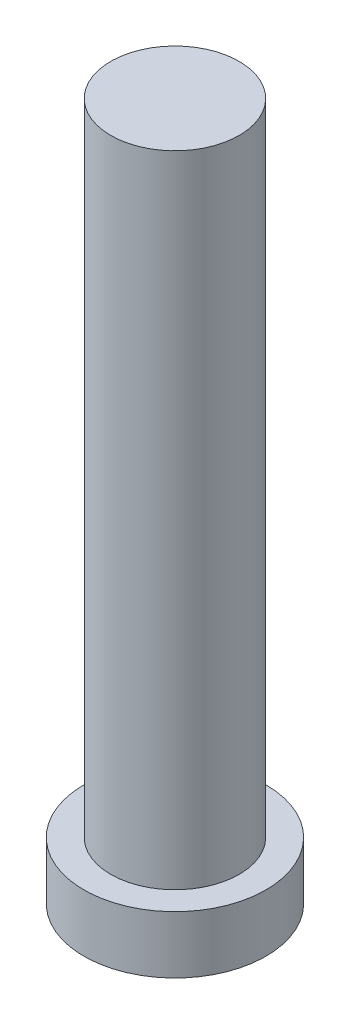
ISO-10303-21;
HEADER;
FILE_DESCRIPTION(('STEP AP214'),'2;1');
FILE_NAME('part.step','',(''),(''),'','','');
FILE_SCHEMA(('AUTOMOTIVE_DESIGN { 1 0 10303 214 1 1 1 1 }'));
ENDSEC;
DATA;
#1=APPLICATION_CONTEXT('core data for automotive mechanical design processes');
#2=APPLICATION_PROTOCOL_DEFINITION('international standard','automotive_design',2000,#1);
#3=PRODUCT_CONTEXT('',#1,'mechanical');
#4=PRODUCT('Part','Part','',(#3));
#5=PRODUCT_RELATED_PRODUCT_CATEGORY('part','',(#4));
#6=PRODUCT_DEFINITION_FORMATION('','',#4);
#7=PRODUCT_DEFINITION_CONTEXT('part definition',#1,'design');
#8=PRODUCT_DEFINITION('design','',#6,#7);
#9=PRODUCT_DEFINITION_SHAPE('','',#8);
#10=(LENGTH_UNIT() NAMED_UNIT(*) SI_UNIT(.MILLI.,.METRE.));
#11=(NAMED_UNIT(*) PLANE_ANGLE_UNIT() SI_UNIT($,.RADIAN.));
#12=(NAMED_UNIT(*) SI_UNIT($,.STERADIAN.) SOLID_ANGLE_UNIT());
#13=UNCERTAINTY_MEASURE_WITH_UNIT(LENGTH_MEASURE(1.E-05),#10,'distance_accuracy_value','');
#14=(GEOMETRIC_REPRESENTATION_CONTEXT(3) GLOBAL_UNCERTAINTY_ASSIGNED_CONTEXT((#13)) GLOBAL_UNIT_ASSIGNED_CONTEXT((#10,
#11,#12)) REPRESENTATION_CONTEXT('',''));
#15=CARTESIAN_POINT('',(0.,0.,0.));
#16=DIRECTION('',(0.,0.,1.));
#17=DIRECTION('',(1.,0.,0.));
#18=AXIS2_PLACEMENT_3D('',#15,#16,#17);
#19=CARTESIAN_POINT('',(0.,33.4,0.));
#20=DIRECTION('',(0.,-1.,0.));
#21=DIRECTION('',(0.,0.,-1.));
#22=AXIS2_PLACEMENT_3D('',#19,#20,#21);
#23=CYLINDRICAL_SURFACE('',#22,3.35000000000001);
#24=CARTESIAN_POINT('',(0.,33.4,0.));
#25=DIRECTION('',(0.,1.,0.));
#26=DIRECTION('',(0.,0.,1.));
#27=AXIS2_PLACEMENT_3D('',#24,#25,#26);
#28=CIRCLE('',#27,3.35000000000001);
#29=CARTESIAN_POINT('',(0.,33.4,3.35000000000001));
#30=VERTEX_POINT('',#29);
#31=EDGE_CURVE('E10',#30,#30,#28,.T.);
#32=ORIENTED_EDGE('',*,*,#31,.F.);
#33=EDGE_LOOP('',(#32));
#34=FACE_BOUND('',#33,.T.);
#35=CARTESIAN_POINT('',(0.,0.,0.));
#36=DIRECTION('',(0.,1.,0.));
#37=DIRECTION('',(0.,0.,1.));
#38=AXIS2_PLACEMENT_3D('',#35,#36,#37);
#39=CIRCLE('',#38,3.35000000000001);
#40=CARTESIAN_POINT('',(0.,0.,3.35000000000001));
#41=VERTEX_POINT('',#40);
#42=EDGE_CURVE('E38',#41,#41,#39,.T.);
#43=ORIENTED_EDGE('',*,*,#42,.T.);
#44=EDGE_LOOP('',(#43));
#45=FACE_BOUND('',#44,.T.);
#46=ADVANCED_FACE('F35',(#34,#45),#23,.T.);
#47=CARTESIAN_POINT('',(0.,33.4,0.));
#48=DIRECTION('',(0.,1.,0.));
#49=DIRECTION('',(0.,0.,1.));
#50=AXIS2_PLACEMENT_3D('',#47,#48,#49);
#51=PLANE('',#50);
#52=ORIENTED_EDGE('',*,*,#31,.T.);
#53=EDGE_LOOP('',(#52));
#54=FACE_BOUND('',#53,.T.);
#55=ADVANCED_FACE('F58',(#54),#51,.T.);
#56=CARTESIAN_POINT('',(0.,-3.,0.));
#57=DIRECTION('',(0.,1.,0.));
#58=DIRECTION('',(0.,0.,1.));
#59=AXIS2_PLACEMENT_3D('',#56,#57,#58);
#60=CYLINDRICAL_SURFACE('',#59,4.75);
#61=CARTESIAN_POINT('',(0.,-3.,0.));
#62=DIRECTION('',(0.,-1.,0.));
#63=DIRECTION('',(0.,0.,-1.));
#64=AXIS2_PLACEMENT_3D('',#61,#62,#63);
#65=CIRCLE('',#64,4.75);
#66=CARTESIAN_POINT('',(0.,-3.,-4.75));
#67=VERTEX_POINT('',#66);
#68=EDGE_CURVE('E45',#67,#67,#65,.T.);
#69=ORIENTED_EDGE('',*,*,#68,.F.);
#70=EDGE_LOOP('',(#69));
#71=FACE_BOUND('',#70,.T.);
#72=CARTESIAN_POINT('',(0.,0.,0.));
#73=DIRECTION('',(0.,-1.,0.));
#74=DIRECTION('',(0.,0.,-1.));
#75=AXIS2_PLACEMENT_3D('',#72,#73,#74);
#76=CIRCLE('',#75,4.75);
#77=CARTESIAN_POINT('',(0.,0.,-4.75));
#78=VERTEX_POINT('',#77);
#79=EDGE_CURVE('E47',#78,#78,#76,.T.);
#80=ORIENTED_EDGE('',*,*,#79,.T.);
#81=EDGE_LOOP('',(#80));
#82=FACE_BOUND('',#81,.T.);
#83=ADVANCED_FACE('F55',(#71,#82),#60,.T.);
#84=CARTESIAN_POINT('',(0.,-3.,0.));
#85=DIRECTION('',(0.,-1.,0.));
#86=DIRECTION('',(0.,0.,-1.));
#87=AXIS2_PLACEMENT_3D('',#84,#85,#86);
#88=PLANE('',#87);
#89=ORIENTED_EDGE('',*,*,#68,.T.);
#90=EDGE_LOOP('',(#89));
#91=FACE_BOUND('',#90,.T.);
#92=ADVANCED_FACE('F53',(#91),#88,.T.);
#93=CARTESIAN_POINT('',(0.,0.,0.));
#94=DIRECTION('',(0.,-1.,0.));
#95=DIRECTION('',(0.,0.,-1.));
#96=AXIS2_PLACEMENT_3D('',#93,#94,#95);
#97=PLANE('',#96);
#98=ORIENTED_EDGE('',*,*,#42,.F.);
#99=EDGE_LOOP('',(#98));
#100=FACE_BOUND('',#99,.T.);
#101=ORIENTED_EDGE('',*,*,#79,.F.);
#102=EDGE_LOOP('',(#101));
#103=FACE_BOUND('',#102,.T.);
#104=ADVANCED_FACE('F62',(#100,#103),#97,.F.);
#105=CLOSED_SHELL('',(#46,#55,#83,#92,#104));
#106=MANIFOLD_SOLID_BREP('B2',#105);
#107=ADVANCED_BREP_SHAPE_REPRESENTATION('',(#18,#106),#14);
#108=SHAPE_DEFINITION_REPRESENTATION(#9,#107);
ENDSEC;
END-ISO-10303-21;
